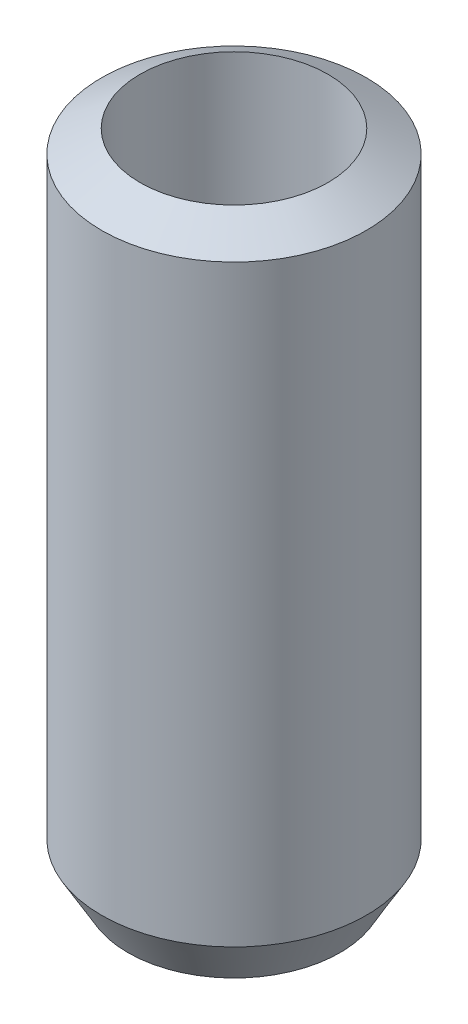
ISO-10303-21;
HEADER;
FILE_DESCRIPTION(('STEP AP214'),'2;1');
FILE_NAME('part.step','',(''),(''),'','','');
FILE_SCHEMA(('AUTOMOTIVE_DESIGN { 1 0 10303 214 1 1 1 1 }'));
ENDSEC;
DATA;
#1=APPLICATION_CONTEXT('core data for automotive mechanical design processes');
#2=APPLICATION_PROTOCOL_DEFINITION('international standard','automotive_design',2000,#1);
#3=PRODUCT_CONTEXT('',#1,'mechanical');
#4=PRODUCT('Part','Part','',(#3));
#5=PRODUCT_RELATED_PRODUCT_CATEGORY('part','',(#4));
#6=PRODUCT_DEFINITION_FORMATION('','',#4);
#7=PRODUCT_DEFINITION_CONTEXT('part definition',#1,'design');
#8=PRODUCT_DEFINITION('design','',#6,#7);
#9=PRODUCT_DEFINITION_SHAPE('','',#8);
#10=(LENGTH_UNIT() NAMED_UNIT(*) SI_UNIT(.MILLI.,.METRE.));
#11=(NAMED_UNIT(*) PLANE_ANGLE_UNIT() SI_UNIT($,.RADIAN.));
#12=(NAMED_UNIT(*) SI_UNIT($,.STERADIAN.) SOLID_ANGLE_UNIT());
#13=UNCERTAINTY_MEASURE_WITH_UNIT(LENGTH_MEASURE(1.E-05),#10,'distance_accuracy_value','');
#14=(GEOMETRIC_REPRESENTATION_CONTEXT(3) GLOBAL_UNCERTAINTY_ASSIGNED_CONTEXT((#13)) GLOBAL_UNIT_ASSIGNED_CONTEXT((#10,
#11,#12)) REPRESENTATION_CONTEXT('',''));
#15=CARTESIAN_POINT('',(0.,0.,0.));
#16=DIRECTION('',(0.,0.,1.));
#17=DIRECTION('',(1.,0.,0.));
#18=AXIS2_PLACEMENT_3D('',#15,#16,#17);
#19=CARTESIAN_POINT('',(0.,87.9081322922114,0.));
#20=DIRECTION('',(0.,-1.,0.));
#21=DIRECTION('',(0.,0.,-1.));
#22=AXIS2_PLACEMENT_3D('',#19,#20,#21);
#23=CYLINDRICAL_SURFACE('',#22,17.5);
#24=CARTESIAN_POINT('',(0.,84.4382507127428,0.));
#25=DIRECTION('',(0.,1.,0.));
#26=DIRECTION('',(0.,0.,1.));
#27=AXIS2_PLACEMENT_3D('',#24,#25,#26);
#28=CIRCLE('',#27,17.5);
#29=CARTESIAN_POINT('',(0.,84.4382507127428,17.5));
#30=VERTEX_POINT('',#29);
#31=EDGE_CURVE('E50',#30,#30,#28,.F.);
#32=ORIENTED_EDGE('',*,*,#31,.T.);
#33=EDGE_LOOP('',(#32));
#34=FACE_BOUND('',#33,.T.);
#35=CARTESIAN_POINT('',(0.,6.01001119188691,0.));
#36=DIRECTION('',(0.,1.,0.));
#37=DIRECTION('',(0.,0.,1.));
#38=AXIS2_PLACEMENT_3D('',#35,#36,#37);
#39=CIRCLE('',#38,17.5);
#40=CARTESIAN_POINT('',(0.,6.01001119188691,17.5));
#41=VERTEX_POINT('',#40);
#42=EDGE_CURVE('E51',#41,#41,#39,.T.);
#43=ORIENTED_EDGE('',*,*,#42,.T.);
#44=EDGE_LOOP('',(#43));
#45=FACE_BOUND('',#44,.T.);
#46=ADVANCED_FACE('F39',(#34,#45),#23,.T.);
#47=CARTESIAN_POINT('',(0.,0.,0.));
#48=DIRECTION('',(0.,1.,0.));
#49=DIRECTION('',(0.,0.,1.));
#50=AXIS2_PLACEMENT_3D('',#47,#48,#49);
#51=PLANE('',#50);
#52=CARTESIAN_POINT('',(0.,0.,0.));
#53=DIRECTION('',(0.,1.,0.));
#54=DIRECTION('',(0.,0.,1.));
#55=AXIS2_PLACEMENT_3D('',#52,#53,#54);
#56=CIRCLE('',#55,14.0301184205314);
#57=CARTESIAN_POINT('',(0.,0.,14.0301184205314));
#58=VERTEX_POINT('',#57);
#59=EDGE_CURVE('E10',#58,#58,#56,.F.);
#60=ORIENTED_EDGE('',*,*,#59,.T.);
#61=EDGE_LOOP('',(#60));
#62=FACE_BOUND('',#61,.T.);
#63=CARTESIAN_POINT('',(0.,0.,0.));
#64=DIRECTION('',(0.,1.,0.));
#65=DIRECTION('',(0.,0.,1.));
#66=AXIS2_PLACEMENT_3D('',#63,#64,#65);
#67=CIRCLE('',#66,12.4187750600032);
#68=CARTESIAN_POINT('',(0.,0.,12.4187750600032));
#69=VERTEX_POINT('',#68);
#70=EDGE_CURVE('E58',#69,#69,#67,.T.);
#71=ORIENTED_EDGE('',*,*,#70,.T.);
#72=EDGE_LOOP('',(#71));
#73=FACE_BOUND('',#72,.T.);
#74=ADVANCED_FACE('F62',(#62,#73),#51,.F.);
#75=CARTESIAN_POINT('',(0.,87.9081322922114,0.));
#76=DIRECTION('',(0.,-1.,0.));
#77=DIRECTION('',(0.,0.,-1.));
#78=AXIS2_PLACEMENT_3D('',#75,#76,#77);
#79=CYLINDRICAL_SURFACE('',#78,12.4187750600032);
#80=CARTESIAN_POINT('',(0.,87.3718972996629,0.));
#81=DIRECTION('',(0.,-1.,0.));
#82=DIRECTION('',(0.,0.,-1.));
#83=AXIS2_PLACEMENT_3D('',#80,#81,#82);
#84=CIRCLE('',#83,12.4187750600032);
#85=CARTESIAN_POINT('',(0.,87.3718972996629,-12.4187750600032));
#86=VERTEX_POINT('',#85);
#87=EDGE_CURVE('E54',#86,#86,#84,.F.);
#88=ORIENTED_EDGE('',*,*,#87,.T.);
#89=EDGE_LOOP('',(#88));
#90=FACE_BOUND('',#89,.T.);
#91=ORIENTED_EDGE('',*,*,#70,.F.);
#92=EDGE_LOOP('',(#91));
#93=FACE_BOUND('',#92,.T.);
#94=ADVANCED_FACE('F68',(#90,#93),#79,.F.);
#95=CARTESIAN_POINT('',(0.,87.9081322922114,0.));
#96=DIRECTION('',(0.,-1.,0.));
#97=DIRECTION('',(0.,0.,-1.));
#98=AXIS2_PLACEMENT_3D('',#95,#96,#97);
#99=CONICAL_SURFACE('',#98,11.489988808113,1.0471975511966);
#100=ORIENTED_EDGE('',*,*,#31,.F.);
#101=EDGE_LOOP('',(#100));
#102=FACE_BOUND('',#101,.T.);
#103=ORIENTED_EDGE('',*,*,#87,.F.);
#104=EDGE_LOOP('',(#103));
#105=FACE_BOUND('',#104,.T.);
#106=ADVANCED_FACE('F66',(#102,#105),#99,.T.);
#107=CARTESIAN_POINT('',(0.,6.01001119188691,0.));
#108=DIRECTION('',(0.,1.,0.));
#109=DIRECTION('',(0.,0.,1.));
#110=AXIS2_PLACEMENT_3D('',#107,#108,#109);
#111=CONICAL_SURFACE('',#110,17.5,0.523598775598303);
#112=CARTESIAN_POINT('',(0.,0.,14.0301184205314));
#113=CARTESIAN_POINT('',(0.,0.0626042832488214,14.0662630203175));
#114=CARTESIAN_POINT('',(0.,0.125208566497643,14.1024076201037));
#115=CARTESIAN_POINT('',(0.,0.250417132995287,14.1746968196759));
#116=CARTESIAN_POINT('',(0.,0.313021416244109,14.2108414194621));
#117=CARTESIAN_POINT('',(0.,0.438229982741752,14.2831306190343));
#118=CARTESIAN_POINT('',(0.,0.500834265990575,14.3192752188205));
#119=CARTESIAN_POINT('',(0.,0.626042832488218,14.3915644183927));
#120=CARTESIAN_POINT('',(0.,0.68864711573704,14.4277090181788));
#121=CARTESIAN_POINT('',(0.,0.813855682234684,14.4999982177511));
#122=CARTESIAN_POINT('',(0.,0.876459965483506,14.5361428175372));
#123=CARTESIAN_POINT('',(0.,1.00166853198115,14.6084320171095));
#124=CARTESIAN_POINT('',(0.,1.06427281522997,14.6445766168956));
#125=CARTESIAN_POINT('',(0.,1.18948138172762,14.7168658164679));
#126=CARTESIAN_POINT('',(0.,1.25208566497644,14.753010416254));
#127=CARTESIAN_POINT('',(0.,1.37729423147408,14.8252996158263));
#128=CARTESIAN_POINT('',(0.,1.4398985147229,14.8614442156124));
#129=CARTESIAN_POINT('',(0.,1.56510708122055,14.9337334151847));
#130=CARTESIAN_POINT('',(0.,1.62771136446937,14.9698780149708));
#131=CARTESIAN_POINT('',(0.,1.75291993096701,15.0421672145431));
#132=CARTESIAN_POINT('',(0.,1.81552421421584,15.0783118143292));
#133=CARTESIAN_POINT('',(0.,1.94073278071348,15.1506010139015));
#134=CARTESIAN_POINT('',(0.,2.0033370639623,15.1867456136876));
#135=CARTESIAN_POINT('',(0.,2.12854563045995,15.2590348132599));
#136=CARTESIAN_POINT('',(0.,2.19114991370877,15.295179413046));
#137=CARTESIAN_POINT('',(0.,2.31635848020641,15.3674686126183));
#138=CARTESIAN_POINT('',(0.,2.37896276345523,15.4036132124044));
#139=CARTESIAN_POINT('',(0.,2.50417132995288,15.4759024119767));
#140=CARTESIAN_POINT('',(0.,2.5667756132017,15.5120470117628));
#141=CARTESIAN_POINT('',(0.,2.69198417969934,15.584336211335));
#142=CARTESIAN_POINT('',(0.,2.75458846294816,15.6204808111212));
#143=CARTESIAN_POINT('',(0.,2.87979702944581,15.6927700106934));
#144=CARTESIAN_POINT('',(0.,2.94240131269463,15.7289146104796));
#145=CARTESIAN_POINT('',(0.,3.06760987919227,15.8012038100518));
#146=CARTESIAN_POINT('',(0.,3.1302141624411,15.837348409838));
#147=CARTESIAN_POINT('',(0.,3.25542272893874,15.9096376094102));
#148=CARTESIAN_POINT('',(0.,3.31802701218756,15.9457822091964));
#149=CARTESIAN_POINT('',(0.,3.44323557868521,16.0180714087686));
#150=CARTESIAN_POINT('',(0.,3.50583986193403,16.0542160085548));
#151=CARTESIAN_POINT('',(0.,3.63104842843167,16.126505208127));
#152=CARTESIAN_POINT('',(0.,3.69365271168049,16.1626498079131));
#153=CARTESIAN_POINT('',(0.,3.81886127817814,16.2349390074854));
#154=CARTESIAN_POINT('',(0.,3.88146556142696,16.2710836072715));
#155=CARTESIAN_POINT('',(0.,4.0066741279246,16.3433728068438));
#156=CARTESIAN_POINT('',(0.,4.06927841117342,16.3795174066299));
#157=CARTESIAN_POINT('',(0.,4.19448697767107,16.4518066062022));
#158=CARTESIAN_POINT('',(0.,4.25709126091989,16.4879512059883));
#159=CARTESIAN_POINT('',(0.,4.38229982741753,16.5602404055606));
#160=CARTESIAN_POINT('',(0.,4.44490411066636,16.5963850053467));
#161=CARTESIAN_POINT('',(0.,4.570112677164,16.668674204919));
#162=CARTESIAN_POINT('',(0.,4.63271696041282,16.7048188047051));
#163=CARTESIAN_POINT('',(0.,4.75792552691047,16.7771080042774));
#164=CARTESIAN_POINT('',(0.,4.82052981015929,16.8132526040635));
#165=CARTESIAN_POINT('',(0.,4.94573837665693,16.8855418036358));
#166=CARTESIAN_POINT('',(0.,5.00834265990575,16.9216864034219));
#167=CARTESIAN_POINT('',(0.,5.1335512264034,16.9939756029942));
#168=CARTESIAN_POINT('',(0.,5.19615550965222,17.0301202027803));
#169=CARTESIAN_POINT('',(0.,5.32136407614986,17.1024094023526));
#170=CARTESIAN_POINT('',(0.,5.38396835939869,17.1385540021387));
#171=CARTESIAN_POINT('',(0.,5.50917692589633,17.210843201711));
#172=CARTESIAN_POINT('',(0.,5.57178120914515,17.2469878014971));
#173=CARTESIAN_POINT('',(0.,5.69698977564279,17.3192770010694));
#174=CARTESIAN_POINT('',(0.,5.75959405889162,17.3554216008555));
#175=CARTESIAN_POINT('',(0.,5.88480262538926,17.4277108004277));
#176=CARTESIAN_POINT('',(0.,5.94740690863808,17.4638554002139));
#177=CARTESIAN_POINT('',(0.,6.01001119188691,17.5));
#178=B_SPLINE_CURVE_WITH_KNOTS('',3,(#112,#113,#114,#115,#116,#117,#118,#119,#120,#121,#122,
#123,#124,#125,#126,#127,#128,#129,#130,#131,#132,#133,#134,#135,#136,#137,#138,#139,#140,#141,
#142,#143,#144,#145,#146,#147,#148,#149,#150,#151,#152,#153,#154,#155,#156,#157,#158,#159,#160,
#161,#162,#163,#164,#165,#166,#167,#168,#169,#170,#171,#172,#173,#174,#175,#176,#177),
.UNSPECIFIED.,.F.,.F.,(4,2,2,2,2,2,2,2,2,2,2,2,2,2,2,2,2,2,2,2,2,2,2,2,2,2,2,2,2,2,2,2,4),(0.,
0.216867598716786,0.433735197433573,0.650602796150358,0.867470394867144,1.08433799358393,
1.30120559230072,1.5180731910175,1.73494078973429,1.95180838845108,2.16867598716786,
2.38554358588465,2.60241118460143,2.81927878331822,3.036146382035,3.25301398075179,
3.46988157946858,3.68674917818536,3.90361677690215,4.12048437561894,4.33735197433572,
4.55421957305251,4.77108717176929,4.98795477048608,5.20482236920287,5.42168996791965,
5.63855756663644,5.85542516535323,6.07229276407001,6.2891603627868,6.50602796150359,
6.72289556022037,6.93976315893716),.UNSPECIFIED.);
#179=EDGE_CURVE('BSEAM45',#58,#41,#178,.T.);
#180=ORIENTED_EDGE('',*,*,#59,.F.);
#181=ORIENTED_EDGE('',*,*,#42,.F.);
#182=ORIENTED_EDGE('',*,*,#179,.T.);
#183=ORIENTED_EDGE('',*,*,#179,.F.);
#184=EDGE_LOOP('',(#180,#182,#181,#183));
#185=FACE_BOUND('',#184,.T.);
#186=ADVANCED_FACE('F45',(#185),#111,.T.);
#187=CLOSED_SHELL('',(#46,#74,#94,#106,#186));
#188=MANIFOLD_SOLID_BREP('B2',#187);
#189=ADVANCED_BREP_SHAPE_REPRESENTATION('',(#18,#188),#14);
#190=SHAPE_DEFINITION_REPRESENTATION(#9,#189);
ENDSEC;
END-ISO-10303-21;
